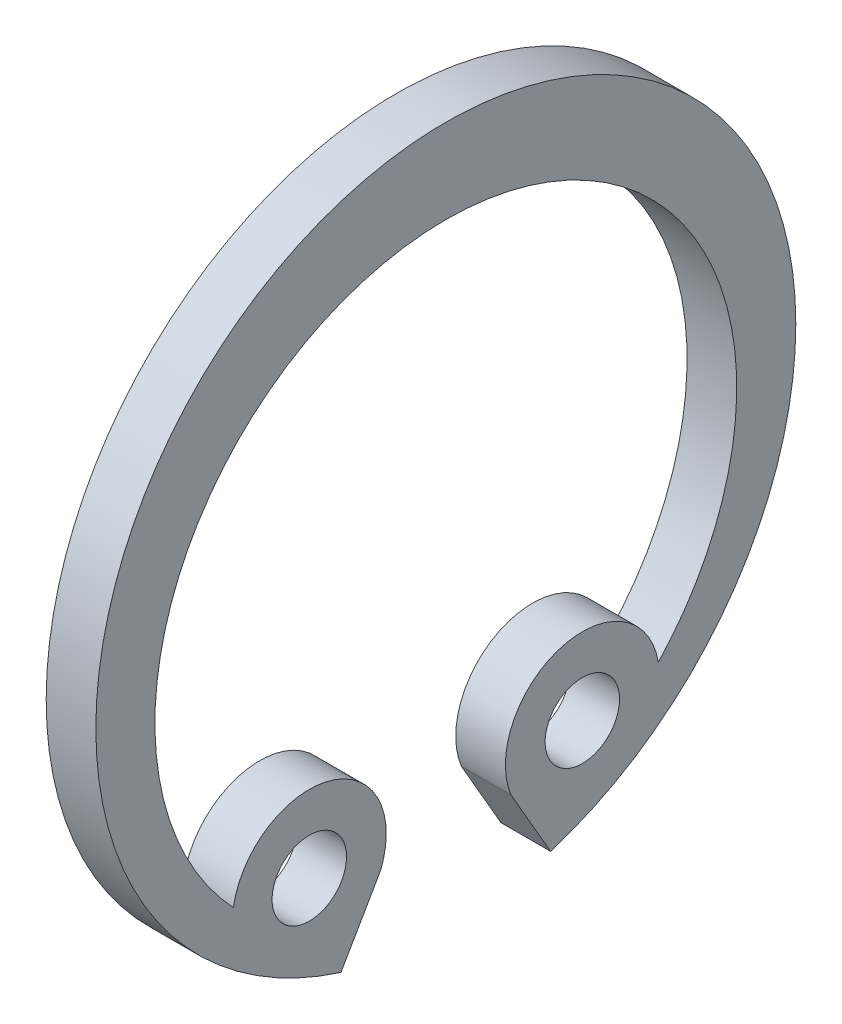
ISO-10303-21;
HEADER;
FILE_DESCRIPTION(('STEP AP214'),'2;1');
FILE_NAME('part.step','',(''),(''),'','','');
FILE_SCHEMA(('AUTOMOTIVE_DESIGN { 1 0 10303 214 1 1 1 1 }'));
ENDSEC;
DATA;
#1=APPLICATION_CONTEXT('core data for automotive mechanical design processes');
#2=APPLICATION_PROTOCOL_DEFINITION('international standard','automotive_design',2000,#1);
#3=PRODUCT_CONTEXT('',#1,'mechanical');
#4=PRODUCT('Part','Part','',(#3));
#5=PRODUCT_RELATED_PRODUCT_CATEGORY('part','',(#4));
#6=PRODUCT_DEFINITION_FORMATION('','',#4);
#7=PRODUCT_DEFINITION_CONTEXT('part definition',#1,'design');
#8=PRODUCT_DEFINITION('design','',#6,#7);
#9=PRODUCT_DEFINITION_SHAPE('','',#8);
#10=(LENGTH_UNIT() NAMED_UNIT(*) SI_UNIT(.MILLI.,.METRE.));
#11=(NAMED_UNIT(*) PLANE_ANGLE_UNIT() SI_UNIT($,.RADIAN.));
#12=(NAMED_UNIT(*) SI_UNIT($,.STERADIAN.) SOLID_ANGLE_UNIT());
#13=UNCERTAINTY_MEASURE_WITH_UNIT(LENGTH_MEASURE(1.E-05),#10,'distance_accuracy_value','');
#14=(GEOMETRIC_REPRESENTATION_CONTEXT(3) GLOBAL_UNCERTAINTY_ASSIGNED_CONTEXT((#13)) GLOBAL_UNIT_ASSIGNED_CONTEXT((#10,
#11,#12)) REPRESENTATION_CONTEXT('',''));
#15=CARTESIAN_POINT('',(0.,0.,0.));
#16=DIRECTION('',(0.,0.,1.));
#17=DIRECTION('',(1.,0.,0.));
#18=AXIS2_PLACEMENT_3D('',#15,#16,#17);
#19=CARTESIAN_POINT('',(0.5,0.,0.));
#20=DIRECTION('',(1.,0.,0.));
#21=DIRECTION('',(0.,0.,-1.));
#22=AXIS2_PLACEMENT_3D('',#19,#20,#21);
#23=PLANE('',#22);
#24=CARTESIAN_POINT('',(0.5,-4.76313972081447,-2.75000000000001));
#25=DIRECTION('',(1.,0.,0.));
#26=DIRECTION('',(0.,0.,-1.));
#27=AXIS2_PLACEMENT_3D('',#24,#25,#26);
#28=CIRCLE('',#27,0.74999999999999);
#29=CARTESIAN_POINT('',(0.5,-4.76313972081447,-3.5));
#30=VERTEX_POINT('',#29);
#31=EDGE_CURVE('E122',#30,#30,#28,.T.);
#32=ORIENTED_EDGE('',*,*,#31,.F.);
#33=EDGE_LOOP('',(#32));
#34=FACE_BOUND('',#33,.T.);
#35=CARTESIAN_POINT('',(0.5,0.,0.));
#36=DIRECTION('',(1.,0.,0.));
#37=DIRECTION('',(0.,0.,-1.));
#38=AXIS2_PLACEMENT_3D('',#35,#36,#37);
#39=CIRCLE('',#38,7.04999999999998);
#40=CARTESIAN_POINT('',(0.5,-6.7263594203613,-2.1115371055504));
#41=VERTEX_POINT('',#40);
#42=CARTESIAN_POINT('',(0.5,-6.7263594203613,2.1115371055504));
#43=VERTEX_POINT('',#42);
#44=EDGE_CURVE('E125',#41,#43,#39,.T.);
#45=ORIENTED_EDGE('',*,*,#44,.T.);
#46=DIRECTION('',(0.,0.866025403784423,-0.500000000000027));
#47=VECTOR('',#46,1.);
#48=CARTESIAN_POINT('',(0.5,-6.7263594203613,2.1115371055504));
#49=LINE('',#48,#47);
#50=CARTESIAN_POINT('',(0.5,-5.34125936754,1.3118492171994));
#51=VERTEX_POINT('',#50);
#52=EDGE_CURVE('E87',#43,#51,#49,.T.);
#53=ORIENTED_EDGE('',*,*,#52,.T.);
#54=CARTESIAN_POINT('',(0.5,-4.76313972081447,2.75000000000001));
#55=DIRECTION('',(1.,0.,0.));
#56=DIRECTION('',(0.,0.,-1.));
#57=AXIS2_PLACEMENT_3D('',#54,#55,#56);
#58=CIRCLE('',#57,1.55000000000002);
#59=CARTESIAN_POINT('',(0.5,-4.5129898262291,4.2796813492486));
#60=VERTEX_POINT('',#59);
#61=EDGE_CURVE('E128',#51,#60,#58,.T.);
#62=ORIENTED_EDGE('',*,*,#61,.T.);
#63=CARTESIAN_POINT('',(0.5,-0.51,0.));
#64=DIRECTION('',(-1.,0.,0.));
#65=DIRECTION('',(0.,0.,1.));
#66=AXIS2_PLACEMENT_3D('',#63,#64,#65);
#67=CIRCLE('',#66,5.86);
#68=CARTESIAN_POINT('',(0.5,-4.5129898262291,-4.2796813492486));
#69=VERTEX_POINT('',#68);
#70=EDGE_CURVE('E130',#60,#69,#67,.T.);
#71=ORIENTED_EDGE('',*,*,#70,.T.);
#72=CARTESIAN_POINT('',(0.5,-4.76313972081447,-2.75000000000001));
#73=DIRECTION('',(1.,0.,0.));
#74=DIRECTION('',(0.,0.,-1.));
#75=AXIS2_PLACEMENT_3D('',#72,#73,#74);
#76=CIRCLE('',#75,1.55000000000002);
#77=CARTESIAN_POINT('',(0.5,-5.34125936754,-1.3118492171994));
#78=VERTEX_POINT('',#77);
#79=EDGE_CURVE('E51',#69,#78,#76,.T.);
#80=ORIENTED_EDGE('',*,*,#79,.T.);
#81=DIRECTION('',(0.,-0.866025403784423,-0.500000000000027));
#82=VECTOR('',#81,1.);
#83=CARTESIAN_POINT('',(0.5,-5.34125936754,-1.3118492171994));
#84=LINE('',#83,#82);
#85=EDGE_CURVE('E46',#78,#41,#84,.T.);
#86=ORIENTED_EDGE('',*,*,#85,.T.);
#87=EDGE_LOOP('',(#45,#53,#62,#71,#80,#86));
#88=FACE_BOUND('',#87,.T.);
#89=CARTESIAN_POINT('',(0.5,-4.76313972081447,2.75000000000001));
#90=DIRECTION('',(1.,0.,0.));
#91=DIRECTION('',(0.,0.,-1.));
#92=AXIS2_PLACEMENT_3D('',#89,#90,#91);
#93=CIRCLE('',#92,0.75000000000001);
#94=CARTESIAN_POINT('',(0.5,-4.76313972081447,2.));
#95=VERTEX_POINT('',#94);
#96=EDGE_CURVE('E119',#95,#95,#93,.T.);
#97=ORIENTED_EDGE('',*,*,#96,.F.);
#98=EDGE_LOOP('',(#97));
#99=FACE_BOUND('',#98,.T.);
#100=ADVANCED_FACE('F31',(#34,#88,#99),#23,.T.);
#101=CARTESIAN_POINT('',(0.5,0.,0.));
#102=DIRECTION('',(-1.,0.,0.));
#103=DIRECTION('',(0.,0.,1.));
#104=AXIS2_PLACEMENT_3D('',#101,#102,#103);
#105=CYLINDRICAL_SURFACE('',#104,7.04999999999998);
#106=DIRECTION('',(-1.,0.,0.));
#107=VECTOR('',#106,1.);
#108=CARTESIAN_POINT('',(0.5,-6.7263594203613,-2.1115371055504));
#109=LINE('',#108,#107);
#110=CARTESIAN_POINT('',(-0.5,-6.7263594203613,-2.1115371055504));
#111=VERTEX_POINT('',#110);
#112=EDGE_CURVE('E102',#41,#111,#109,.T.);
#113=ORIENTED_EDGE('',*,*,#112,.T.);
#114=CARTESIAN_POINT('',(-0.5,0.,0.));
#115=DIRECTION('',(1.,0.,0.));
#116=DIRECTION('',(0.,0.,-1.));
#117=AXIS2_PLACEMENT_3D('',#114,#115,#116);
#118=CIRCLE('',#117,7.04999999999998);
#119=CARTESIAN_POINT('',(-0.5,-6.7263594203613,2.1115371055504));
#120=VERTEX_POINT('',#119);
#121=EDGE_CURVE('E96',#111,#120,#118,.T.);
#122=ORIENTED_EDGE('',*,*,#121,.T.);
#123=DIRECTION('',(-1.,0.,0.));
#124=VECTOR('',#123,1.);
#125=CARTESIAN_POINT('',(0.5,-6.7263594203613,2.1115371055504));
#126=LINE('',#125,#124);
#127=EDGE_CURVE('E11',#43,#120,#126,.T.);
#128=ORIENTED_EDGE('',*,*,#127,.F.);
#129=ORIENTED_EDGE('',*,*,#44,.F.);
#130=EDGE_LOOP('',(#113,#122,#128,#129));
#131=FACE_BOUND('',#130,.T.);
#132=ADVANCED_FACE('F33',(#131),#105,.T.);
#133=CARTESIAN_POINT('',(0.5,-6.7263594203613,2.1115371055504));
#134=DIRECTION('',(0.,0.500000000000027,0.866025403784423));
#135=DIRECTION('',(0.,-0.866025403784423,0.500000000000027));
#136=AXIS2_PLACEMENT_3D('',#133,#134,#135);
#137=PLANE('',#136);
#138=ORIENTED_EDGE('',*,*,#127,.T.);
#139=DIRECTION('',(0.,0.866025403784423,-0.500000000000027));
#140=VECTOR('',#139,1.);
#141=CARTESIAN_POINT('',(-0.5,-6.7263594203613,2.1115371055504));
#142=LINE('',#141,#140);
#143=CARTESIAN_POINT('',(-0.5,-5.34125936754,1.3118492171994));
#144=VERTEX_POINT('',#143);
#145=EDGE_CURVE('E86',#120,#144,#142,.T.);
#146=ORIENTED_EDGE('',*,*,#145,.T.);
#147=DIRECTION('',(-1.,0.,0.));
#148=VECTOR('',#147,1.);
#149=CARTESIAN_POINT('',(0.5,-5.34125936754,1.3118492171994));
#150=LINE('',#149,#148);
#151=EDGE_CURVE('E39',#51,#144,#150,.T.);
#152=ORIENTED_EDGE('',*,*,#151,.F.);
#153=ORIENTED_EDGE('',*,*,#52,.F.);
#154=EDGE_LOOP('',(#138,#146,#152,#153));
#155=FACE_BOUND('',#154,.T.);
#156=ADVANCED_FACE('F84',(#155),#137,.F.);
#157=CARTESIAN_POINT('',(0.5,-4.76313972081447,2.75000000000001));
#158=DIRECTION('',(-1.,0.,0.));
#159=DIRECTION('',(0.,0.,1.));
#160=AXIS2_PLACEMENT_3D('',#157,#158,#159);
#161=CYLINDRICAL_SURFACE('',#160,1.55000000000002);
#162=ORIENTED_EDGE('',*,*,#151,.T.);
#163=CARTESIAN_POINT('',(-0.5,-4.76313972081447,2.75000000000001));
#164=DIRECTION('',(1.,0.,0.));
#165=DIRECTION('',(0.,0.,-1.));
#166=AXIS2_PLACEMENT_3D('',#163,#164,#165);
#167=CIRCLE('',#166,1.55000000000002);
#168=CARTESIAN_POINT('',(-0.5,-4.5129898262291,4.2796813492486));
#169=VERTEX_POINT('',#168);
#170=EDGE_CURVE('E100',#144,#169,#167,.T.);
#171=ORIENTED_EDGE('',*,*,#170,.T.);
#172=DIRECTION('',(-1.,0.,0.));
#173=VECTOR('',#172,1.);
#174=CARTESIAN_POINT('',(0.5,-4.5129898262291,4.2796813492486));
#175=LINE('',#174,#173);
#176=EDGE_CURVE('E139',#60,#169,#175,.T.);
#177=ORIENTED_EDGE('',*,*,#176,.F.);
#178=ORIENTED_EDGE('',*,*,#61,.F.);
#179=EDGE_LOOP('',(#162,#171,#177,#178));
#180=FACE_BOUND('',#179,.T.);
#181=ADVANCED_FACE('F142',(#180),#161,.T.);
#182=CARTESIAN_POINT('',(0.5,-0.51,0.));
#183=DIRECTION('',(-1.,0.,0.));
#184=DIRECTION('',(0.,0.,1.));
#185=AXIS2_PLACEMENT_3D('',#182,#183,#184);
#186=CYLINDRICAL_SURFACE('',#185,5.86);
#187=ORIENTED_EDGE('',*,*,#176,.T.);
#188=CARTESIAN_POINT('',(-0.5,-0.51,0.));
#189=DIRECTION('',(-1.,0.,0.));
#190=DIRECTION('',(0.,0.,1.));
#191=AXIS2_PLACEMENT_3D('',#188,#189,#190);
#192=CIRCLE('',#191,5.86);
#193=CARTESIAN_POINT('',(-0.5,-4.5129898262291,-4.2796813492486));
#194=VERTEX_POINT('',#193);
#195=EDGE_CURVE('E111',#169,#194,#192,.T.);
#196=ORIENTED_EDGE('',*,*,#195,.T.);
#197=DIRECTION('',(-1.,0.,0.));
#198=VECTOR('',#197,1.);
#199=CARTESIAN_POINT('',(0.5,-4.5129898262291,-4.2796813492486));
#200=LINE('',#199,#198);
#201=EDGE_CURVE('E137',#69,#194,#200,.T.);
#202=ORIENTED_EDGE('',*,*,#201,.F.);
#203=ORIENTED_EDGE('',*,*,#70,.F.);
#204=EDGE_LOOP('',(#187,#196,#202,#203));
#205=FACE_BOUND('',#204,.T.);
#206=ADVANCED_FACE('F148',(#205),#186,.F.);
#207=CARTESIAN_POINT('',(0.5,-4.76313972081447,-2.75000000000001));
#208=DIRECTION('',(-1.,0.,0.));
#209=DIRECTION('',(0.,0.,1.));
#210=AXIS2_PLACEMENT_3D('',#207,#208,#209);
#211=CYLINDRICAL_SURFACE('',#210,1.55000000000002);
#212=ORIENTED_EDGE('',*,*,#201,.T.);
#213=CARTESIAN_POINT('',(-0.5,-4.76313972081447,-2.75000000000001));
#214=DIRECTION('',(1.,0.,0.));
#215=DIRECTION('',(0.,0.,-1.));
#216=AXIS2_PLACEMENT_3D('',#213,#214,#215);
#217=CIRCLE('',#216,1.55000000000002);
#218=CARTESIAN_POINT('',(-0.5,-5.34125936754,-1.3118492171994));
#219=VERTEX_POINT('',#218);
#220=EDGE_CURVE('E114',#194,#219,#217,.T.);
#221=ORIENTED_EDGE('',*,*,#220,.T.);
#222=DIRECTION('',(-1.,0.,0.));
#223=VECTOR('',#222,1.);
#224=CARTESIAN_POINT('',(0.5,-5.34125936754,-1.3118492171994));
#225=LINE('',#224,#223);
#226=EDGE_CURVE('E135',#78,#219,#225,.T.);
#227=ORIENTED_EDGE('',*,*,#226,.F.);
#228=ORIENTED_EDGE('',*,*,#79,.F.);
#229=EDGE_LOOP('',(#212,#221,#227,#228));
#230=FACE_BOUND('',#229,.T.);
#231=ADVANCED_FACE('F151',(#230),#211,.T.);
#232=CARTESIAN_POINT('',(0.5,-5.34125936754,-1.3118492171994));
#233=DIRECTION('',(0.,0.500000000000027,-0.866025403784423));
#234=DIRECTION('',(0.,0.866025403784423,0.500000000000027));
#235=AXIS2_PLACEMENT_3D('',#232,#233,#234);
#236=PLANE('',#235);
#237=ORIENTED_EDGE('',*,*,#226,.T.);
#238=DIRECTION('',(0.,-0.866025403784423,-0.500000000000027));
#239=VECTOR('',#238,1.);
#240=CARTESIAN_POINT('',(-0.5,-5.34125936754,-1.3118492171994));
#241=LINE('',#240,#239);
#242=EDGE_CURVE('E117',#219,#111,#241,.T.);
#243=ORIENTED_EDGE('',*,*,#242,.T.);
#244=ORIENTED_EDGE('',*,*,#112,.F.);
#245=ORIENTED_EDGE('',*,*,#85,.F.);
#246=EDGE_LOOP('',(#237,#243,#244,#245));
#247=FACE_BOUND('',#246,.T.);
#248=ADVANCED_FACE('F153',(#247),#236,.F.);
#249=CARTESIAN_POINT('',(0.5,-4.76313972081447,-2.75000000000001));
#250=DIRECTION('',(-1.,0.,0.));
#251=DIRECTION('',(0.,0.,1.));
#252=AXIS2_PLACEMENT_3D('',#249,#250,#251);
#253=CYLINDRICAL_SURFACE('',#252,0.74999999999999);
#254=ORIENTED_EDGE('',*,*,#31,.T.);
#255=EDGE_LOOP('',(#254));
#256=FACE_BOUND('',#255,.T.);
#257=CARTESIAN_POINT('',(-0.5,-4.76313972081447,-2.75000000000001));
#258=DIRECTION('',(1.,0.,0.));
#259=DIRECTION('',(0.,0.,-1.));
#260=AXIS2_PLACEMENT_3D('',#257,#258,#259);
#261=CIRCLE('',#260,0.74999999999999);
#262=CARTESIAN_POINT('',(-0.5,-4.76313972081447,-3.5));
#263=VERTEX_POINT('',#262);
#264=EDGE_CURVE('E103',#263,#263,#261,.T.);
#265=ORIENTED_EDGE('',*,*,#264,.F.);
#266=EDGE_LOOP('',(#265));
#267=FACE_BOUND('',#266,.T.);
#268=ADVANCED_FACE('F155',(#256,#267),#253,.F.);
#269=CARTESIAN_POINT('',(0.5,-4.76313972081447,2.75000000000001));
#270=DIRECTION('',(-1.,0.,0.));
#271=DIRECTION('',(0.,0.,1.));
#272=AXIS2_PLACEMENT_3D('',#269,#270,#271);
#273=CYLINDRICAL_SURFACE('',#272,0.75000000000001);
#274=ORIENTED_EDGE('',*,*,#96,.T.);
#275=EDGE_LOOP('',(#274));
#276=FACE_BOUND('',#275,.T.);
#277=CARTESIAN_POINT('',(-0.5,-4.76313972081447,2.75000000000001));
#278=DIRECTION('',(1.,0.,0.));
#279=DIRECTION('',(0.,0.,-1.));
#280=AXIS2_PLACEMENT_3D('',#277,#278,#279);
#281=CIRCLE('',#280,0.75000000000001);
#282=CARTESIAN_POINT('',(-0.5,-4.76313972081447,2.));
#283=VERTEX_POINT('',#282);
#284=EDGE_CURVE('E106',#283,#283,#281,.T.);
#285=ORIENTED_EDGE('',*,*,#284,.F.);
#286=EDGE_LOOP('',(#285));
#287=FACE_BOUND('',#286,.T.);
#288=ADVANCED_FACE('F161',(#276,#287),#273,.F.);
#289=CARTESIAN_POINT('',(-0.5,0.,0.));
#290=DIRECTION('',(1.,0.,0.));
#291=DIRECTION('',(0.,0.,-1.));
#292=AXIS2_PLACEMENT_3D('',#289,#290,#291);
#293=PLANE('',#292);
#294=ORIENTED_EDGE('',*,*,#284,.T.);
#295=EDGE_LOOP('',(#294));
#296=FACE_BOUND('',#295,.T.);
#297=ORIENTED_EDGE('',*,*,#264,.T.);
#298=EDGE_LOOP('',(#297));
#299=FACE_BOUND('',#298,.T.);
#300=ORIENTED_EDGE('',*,*,#121,.F.);
#301=ORIENTED_EDGE('',*,*,#242,.F.);
#302=ORIENTED_EDGE('',*,*,#220,.F.);
#303=ORIENTED_EDGE('',*,*,#195,.F.);
#304=ORIENTED_EDGE('',*,*,#170,.F.);
#305=ORIENTED_EDGE('',*,*,#145,.F.);
#306=EDGE_LOOP('',(#300,#301,#302,#303,#304,#305));
#307=FACE_BOUND('',#306,.T.);
#308=ADVANCED_FACE('F94',(#296,#299,#307),#293,.F.);
#309=CLOSED_SHELL('',(#100,#132,#156,#181,#206,#231,#248,#268,#288,#308));
#310=MANIFOLD_SOLID_BREP('B2',#309);
#311=ADVANCED_BREP_SHAPE_REPRESENTATION('',(#18,#310),#14);
#312=SHAPE_DEFINITION_REPRESENTATION(#9,#311);
ENDSEC;
END-ISO-10303-21;
